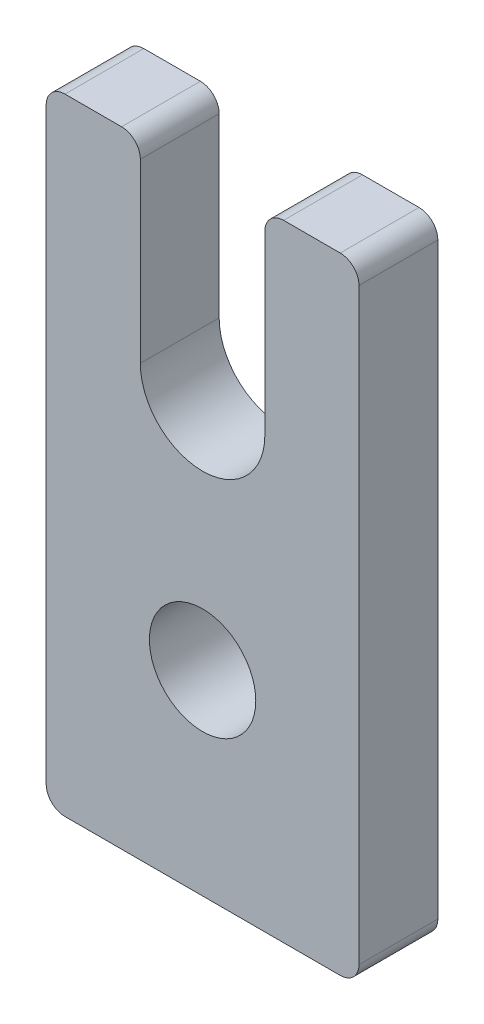
ISO-10303-21;
HEADER;
FILE_DESCRIPTION(('STEP AP214'),'2;1');
FILE_NAME('part.step','',(''),(''),'','','');
FILE_SCHEMA(('AUTOMOTIVE_DESIGN { 1 0 10303 214 1 1 1 1 }'));
ENDSEC;
DATA;
#1=APPLICATION_CONTEXT('core data for automotive mechanical design processes');
#2=APPLICATION_PROTOCOL_DEFINITION('international standard','automotive_design',2000,#1);
#3=PRODUCT_CONTEXT('',#1,'mechanical');
#4=PRODUCT('Part','Part','',(#3));
#5=PRODUCT_RELATED_PRODUCT_CATEGORY('part','',(#4));
#6=PRODUCT_DEFINITION_FORMATION('','',#4);
#7=PRODUCT_DEFINITION_CONTEXT('part definition',#1,'design');
#8=PRODUCT_DEFINITION('design','',#6,#7);
#9=PRODUCT_DEFINITION_SHAPE('','',#8);
#10=(LENGTH_UNIT() NAMED_UNIT(*) SI_UNIT(.MILLI.,.METRE.));
#11=(NAMED_UNIT(*) PLANE_ANGLE_UNIT() SI_UNIT($,.RADIAN.));
#12=(NAMED_UNIT(*) SI_UNIT($,.STERADIAN.) SOLID_ANGLE_UNIT());
#13=UNCERTAINTY_MEASURE_WITH_UNIT(LENGTH_MEASURE(1.E-05),#10,'distance_accuracy_value','');
#14=(GEOMETRIC_REPRESENTATION_CONTEXT(3) GLOBAL_UNCERTAINTY_ASSIGNED_CONTEXT((#13)) GLOBAL_UNIT_ASSIGNED_CONTEXT((#10,
#11,#12)) REPRESENTATION_CONTEXT('',''));
#15=CARTESIAN_POINT('',(0.,0.,0.));
#16=DIRECTION('',(0.,0.,1.));
#17=DIRECTION('',(1.,0.,0.));
#18=AXIS2_PLACEMENT_3D('',#15,#16,#17);
#19=CARTESIAN_POINT('',(6.35,17.4625,3.2004));
#20=DIRECTION('',(0.,0.,1.));
#21=DIRECTION('',(1.,0.,0.));
#22=AXIS2_PLACEMENT_3D('',#19,#20,#21);
#23=PLANE('',#22);
#24=DIRECTION('',(1.,0.,0.));
#25=VECTOR('',#24,1.);
#26=CARTESIAN_POINT('',(0.,0.,3.2004));
#27=LINE('',#26,#25);
#28=CARTESIAN_POINT('',(0.762,0.,3.2004));
#29=VERTEX_POINT('',#28);
#30=CARTESIAN_POINT('',(11.938,0.,3.2004));
#31=VERTEX_POINT('',#30);
#32=EDGE_CURVE('E255',#29,#31,#27,.T.);
#33=ORIENTED_EDGE('',*,*,#32,.T.);
#34=CARTESIAN_POINT('',(11.938,0.762000000000002,3.2004));
#35=DIRECTION('',(0.,0.,1.));
#36=DIRECTION('',(1.,0.,0.));
#37=AXIS2_PLACEMENT_3D('',#34,#35,#36);
#38=CIRCLE('',#37,0.762);
#39=CARTESIAN_POINT('',(12.7,0.762000000000002,3.2004));
#40=VERTEX_POINT('',#39);
#41=EDGE_CURVE('E214',#31,#40,#38,.T.);
#42=ORIENTED_EDGE('',*,*,#41,.T.);
#43=DIRECTION('',(0.,1.,0.));
#44=VECTOR('',#43,1.);
#45=CARTESIAN_POINT('',(12.7,25.4,3.2004));
#46=LINE('',#45,#44);
#47=CARTESIAN_POINT('',(12.7,24.638,3.2004));
#48=VERTEX_POINT('',#47);
#49=EDGE_CURVE('E257',#40,#48,#46,.T.);
#50=ORIENTED_EDGE('',*,*,#49,.T.);
#51=CARTESIAN_POINT('',(11.938,24.638,3.2004));
#52=DIRECTION('',(0.,0.,1.));
#53=DIRECTION('',(1.,0.,0.));
#54=AXIS2_PLACEMENT_3D('',#51,#52,#53);
#55=CIRCLE('',#54,0.762);
#56=CARTESIAN_POINT('',(11.938,25.4,3.2004));
#57=VERTEX_POINT('',#56);
#58=EDGE_CURVE('E207',#48,#57,#55,.T.);
#59=ORIENTED_EDGE('',*,*,#58,.T.);
#60=DIRECTION('',(-1.,0.,0.));
#61=VECTOR('',#60,1.);
#62=CARTESIAN_POINT('',(8.8773,25.4,3.2004));
#63=LINE('',#62,#61);
#64=CARTESIAN_POINT('',(9.6393,25.4,3.2004));
#65=VERTEX_POINT('',#64);
#66=EDGE_CURVE('E142',#57,#65,#63,.T.);
#67=ORIENTED_EDGE('',*,*,#66,.T.);
#68=CARTESIAN_POINT('',(9.6393,24.638,3.2004));
#69=DIRECTION('',(0.,0.,1.));
#70=DIRECTION('',(1.,0.,0.));
#71=AXIS2_PLACEMENT_3D('',#68,#69,#70);
#72=CIRCLE('',#71,0.762);
#73=CARTESIAN_POINT('',(8.8773,24.638,3.2004));
#74=VERTEX_POINT('',#73);
#75=EDGE_CURVE('E54',#65,#74,#72,.T.);
#76=ORIENTED_EDGE('',*,*,#75,.T.);
#77=DIRECTION('',(0.,-1.,0.));
#78=VECTOR('',#77,1.);
#79=CARTESIAN_POINT('',(8.8773,25.4,3.2004));
#80=LINE('',#79,#78);
#81=CARTESIAN_POINT('',(8.8773,17.4625,3.2004));
#82=VERTEX_POINT('',#81);
#83=EDGE_CURVE('E132',#74,#82,#80,.T.);
#84=ORIENTED_EDGE('',*,*,#83,.T.);
#85=CARTESIAN_POINT('',(6.35,17.4625,3.2004));
#86=DIRECTION('',(0.,0.,-1.));
#87=DIRECTION('',(1.,0.,0.));
#88=AXIS2_PLACEMENT_3D('',#85,#86,#87);
#89=CIRCLE('',#88,2.5273);
#90=CARTESIAN_POINT('',(3.8227,17.4625,3.2004));
#91=VERTEX_POINT('',#90);
#92=EDGE_CURVE('E137',#82,#91,#89,.T.);
#93=ORIENTED_EDGE('',*,*,#92,.T.);
#94=DIRECTION('',(0.,1.,0.));
#95=VECTOR('',#94,1.);
#96=CARTESIAN_POINT('',(3.8227,25.4,3.2004));
#97=LINE('',#96,#95);
#98=CARTESIAN_POINT('',(3.8227,24.638,3.2004));
#99=VERTEX_POINT('',#98);
#100=EDGE_CURVE('E156',#91,#99,#97,.T.);
#101=ORIENTED_EDGE('',*,*,#100,.T.);
#102=CARTESIAN_POINT('',(3.0607,24.638,3.2004));
#103=DIRECTION('',(0.,0.,1.));
#104=DIRECTION('',(1.,0.,0.));
#105=AXIS2_PLACEMENT_3D('',#102,#103,#104);
#106=CIRCLE('',#105,0.762);
#107=CARTESIAN_POINT('',(3.0607,25.4,3.2004));
#108=VERTEX_POINT('',#107);
#109=EDGE_CURVE('E209',#99,#108,#106,.T.);
#110=ORIENTED_EDGE('',*,*,#109,.T.);
#111=DIRECTION('',(-1.,0.,0.));
#112=VECTOR('',#111,1.);
#113=CARTESIAN_POINT('',(0.,25.4,3.2004));
#114=LINE('',#113,#112);
#115=CARTESIAN_POINT('',(0.762,25.4,3.2004));
#116=VERTEX_POINT('',#115);
#117=EDGE_CURVE('E182',#108,#116,#114,.T.);
#118=ORIENTED_EDGE('',*,*,#117,.T.);
#119=CARTESIAN_POINT('',(0.762,24.638,3.2004));
#120=DIRECTION('',(0.,0.,1.));
#121=DIRECTION('',(1.,0.,0.));
#122=AXIS2_PLACEMENT_3D('',#119,#120,#121);
#123=CIRCLE('',#122,0.762);
#124=CARTESIAN_POINT('',(0.,24.638,3.2004));
#125=VERTEX_POINT('',#124);
#126=EDGE_CURVE('E205',#116,#125,#123,.T.);
#127=ORIENTED_EDGE('',*,*,#126,.T.);
#128=DIRECTION('',(0.,-1.,0.));
#129=VECTOR('',#128,1.);
#130=CARTESIAN_POINT('',(0.,25.4,3.2004));
#131=LINE('',#130,#129);
#132=CARTESIAN_POINT('',(0.,0.761999999999999,3.2004));
#133=VERTEX_POINT('',#132);
#134=EDGE_CURVE('E253',#125,#133,#131,.T.);
#135=ORIENTED_EDGE('',*,*,#134,.T.);
#136=CARTESIAN_POINT('',(0.762,0.762,3.2004));
#137=DIRECTION('',(0.,0.,1.));
#138=DIRECTION('',(1.,0.,0.));
#139=AXIS2_PLACEMENT_3D('',#136,#137,#138);
#140=CIRCLE('',#139,0.762);
#141=EDGE_CURVE('E212',#133,#29,#140,.T.);
#142=ORIENTED_EDGE('',*,*,#141,.T.);
#143=EDGE_LOOP('',(#33,#42,#50,#59,#67,#76,#84,#93,#101,#110,#118,#127,#135,#142));
#144=FACE_BOUND('',#143,.T.);
#145=CARTESIAN_POINT('',(6.35,7.9375,3.2004));
#146=DIRECTION('',(0.,0.,1.));
#147=DIRECTION('',(1.,0.,0.));
#148=AXIS2_PLACEMENT_3D('',#145,#146,#147);
#149=CIRCLE('',#148,2.159);
#150=CARTESIAN_POINT('',(8.509,7.9375,3.2004));
#151=VERTEX_POINT('',#150);
#152=EDGE_CURVE('E165',#151,#151,#149,.T.);
#153=ORIENTED_EDGE('',*,*,#152,.F.);
#154=EDGE_LOOP('',(#153));
#155=FACE_BOUND('',#154,.T.);
#156=ADVANCED_FACE('F33',(#144,#155),#23,.T.);
#157=CARTESIAN_POINT('',(6.35,17.4625,0.));
#158=DIRECTION('',(0.,0.,1.));
#159=DIRECTION('',(1.,0.,0.));
#160=AXIS2_PLACEMENT_3D('',#157,#158,#159);
#161=PLANE('',#160);
#162=DIRECTION('',(0.,1.,0.));
#163=VECTOR('',#162,1.);
#164=CARTESIAN_POINT('',(12.7,25.4,0.));
#165=LINE('',#164,#163);
#166=CARTESIAN_POINT('',(12.7,0.762000000000002,0.));
#167=VERTEX_POINT('',#166);
#168=CARTESIAN_POINT('',(12.7,24.638,0.));
#169=VERTEX_POINT('',#168);
#170=EDGE_CURVE('E171',#167,#169,#165,.T.);
#171=ORIENTED_EDGE('',*,*,#170,.F.);
#172=CARTESIAN_POINT('',(11.938,0.762000000000002,0.));
#173=DIRECTION('',(0.,0.,1.));
#174=DIRECTION('',(1.,0.,0.));
#175=AXIS2_PLACEMENT_3D('',#172,#173,#174);
#176=CIRCLE('',#175,0.762);
#177=CARTESIAN_POINT('',(11.938,0.,0.));
#178=VERTEX_POINT('',#177);
#179=EDGE_CURVE('E198',#167,#178,#176,.F.);
#180=ORIENTED_EDGE('',*,*,#179,.T.);
#181=DIRECTION('',(1.,0.,0.));
#182=VECTOR('',#181,1.);
#183=CARTESIAN_POINT('',(0.,0.,0.));
#184=LINE('',#183,#182);
#185=CARTESIAN_POINT('',(0.762,0.,0.));
#186=VERTEX_POINT('',#185);
#187=EDGE_CURVE('E168',#186,#178,#184,.T.);
#188=ORIENTED_EDGE('',*,*,#187,.F.);
#189=CARTESIAN_POINT('',(0.762,0.762,0.));
#190=DIRECTION('',(0.,0.,1.));
#191=DIRECTION('',(1.,0.,0.));
#192=AXIS2_PLACEMENT_3D('',#189,#190,#191);
#193=CIRCLE('',#192,0.762);
#194=CARTESIAN_POINT('',(0.,0.761999999999999,0.));
#195=VERTEX_POINT('',#194);
#196=EDGE_CURVE('E196',#186,#195,#193,.F.);
#197=ORIENTED_EDGE('',*,*,#196,.T.);
#198=DIRECTION('',(0.,-1.,0.));
#199=VECTOR('',#198,1.);
#200=CARTESIAN_POINT('',(0.,25.4,0.));
#201=LINE('',#200,#199);
#202=CARTESIAN_POINT('',(0.,24.638,0.));
#203=VERTEX_POINT('',#202);
#204=EDGE_CURVE('E164',#203,#195,#201,.T.);
#205=ORIENTED_EDGE('',*,*,#204,.F.);
#206=CARTESIAN_POINT('',(0.762,24.638,0.));
#207=DIRECTION('',(0.,0.,1.));
#208=DIRECTION('',(1.,0.,0.));
#209=AXIS2_PLACEMENT_3D('',#206,#207,#208);
#210=CIRCLE('',#209,0.762);
#211=CARTESIAN_POINT('',(0.762,25.4,0.));
#212=VERTEX_POINT('',#211);
#213=EDGE_CURVE('E188',#203,#212,#210,.F.);
#214=ORIENTED_EDGE('',*,*,#213,.T.);
#215=DIRECTION('',(-1.,0.,0.));
#216=VECTOR('',#215,1.);
#217=CARTESIAN_POINT('',(0.,25.4,0.));
#218=LINE('',#217,#216);
#219=CARTESIAN_POINT('',(3.0607,25.4,0.));
#220=VERTEX_POINT('',#219);
#221=EDGE_CURVE('E161',#220,#212,#218,.T.);
#222=ORIENTED_EDGE('',*,*,#221,.F.);
#223=CARTESIAN_POINT('',(3.0607,24.638,0.));
#224=DIRECTION('',(0.,0.,1.));
#225=DIRECTION('',(1.,0.,0.));
#226=AXIS2_PLACEMENT_3D('',#223,#224,#225);
#227=CIRCLE('',#226,0.762);
#228=CARTESIAN_POINT('',(3.8227,24.638,0.));
#229=VERTEX_POINT('',#228);
#230=EDGE_CURVE('E192',#220,#229,#227,.F.);
#231=ORIENTED_EDGE('',*,*,#230,.T.);
#232=DIRECTION('',(0.,1.,0.));
#233=VECTOR('',#232,1.);
#234=CARTESIAN_POINT('',(3.8227,25.4,0.));
#235=LINE('',#234,#233);
#236=CARTESIAN_POINT('',(3.8227,17.4625,0.));
#237=VERTEX_POINT('',#236);
#238=EDGE_CURVE('E180',#237,#229,#235,.T.);
#239=ORIENTED_EDGE('',*,*,#238,.F.);
#240=CARTESIAN_POINT('',(6.35,17.4625,0.));
#241=DIRECTION('',(0.,0.,-1.));
#242=DIRECTION('',(1.,0.,0.));
#243=AXIS2_PLACEMENT_3D('',#240,#241,#242);
#244=CIRCLE('',#243,2.5273);
#245=CARTESIAN_POINT('',(8.8773,17.4625,0.));
#246=VERTEX_POINT('',#245);
#247=EDGE_CURVE('E178',#246,#237,#244,.T.);
#248=ORIENTED_EDGE('',*,*,#247,.F.);
#249=DIRECTION('',(0.,-1.,0.));
#250=VECTOR('',#249,1.);
#251=CARTESIAN_POINT('',(8.8773,25.4,0.));
#252=LINE('',#251,#250);
#253=CARTESIAN_POINT('',(8.8773,24.638,0.));
#254=VERTEX_POINT('',#253);
#255=EDGE_CURVE('E148',#254,#246,#252,.T.);
#256=ORIENTED_EDGE('',*,*,#255,.F.);
#257=CARTESIAN_POINT('',(9.6393,24.638,0.));
#258=DIRECTION('',(0.,0.,1.));
#259=DIRECTION('',(1.,0.,0.));
#260=AXIS2_PLACEMENT_3D('',#257,#258,#259);
#261=CIRCLE('',#260,0.762);
#262=CARTESIAN_POINT('',(9.6393,25.4,0.));
#263=VERTEX_POINT('',#262);
#264=EDGE_CURVE('E194',#254,#263,#261,.F.);
#265=ORIENTED_EDGE('',*,*,#264,.T.);
#266=DIRECTION('',(-1.,0.,0.));
#267=VECTOR('',#266,1.);
#268=CARTESIAN_POINT('',(8.8773,25.4,0.));
#269=LINE('',#268,#267);
#270=CARTESIAN_POINT('',(11.938,25.4,0.));
#271=VERTEX_POINT('',#270);
#272=EDGE_CURVE('E174',#271,#263,#269,.T.);
#273=ORIENTED_EDGE('',*,*,#272,.F.);
#274=CARTESIAN_POINT('',(11.938,24.638,0.));
#275=DIRECTION('',(0.,0.,1.));
#276=DIRECTION('',(1.,0.,0.));
#277=AXIS2_PLACEMENT_3D('',#274,#275,#276);
#278=CIRCLE('',#277,0.762);
#279=EDGE_CURVE('E190',#271,#169,#278,.F.);
#280=ORIENTED_EDGE('',*,*,#279,.T.);
#281=EDGE_LOOP('',(#171,#180,#188,#197,#205,#214,#222,#231,#239,#248,#256,#265,#273,#280));
#282=FACE_BOUND('',#281,.T.);
#283=CARTESIAN_POINT('',(6.35,7.9375,0.));
#284=DIRECTION('',(0.,0.,1.));
#285=DIRECTION('',(1.,0.,0.));
#286=AXIS2_PLACEMENT_3D('',#283,#284,#285);
#287=CIRCLE('',#286,2.159);
#288=CARTESIAN_POINT('',(8.509,7.9375,0.));
#289=VERTEX_POINT('',#288);
#290=EDGE_CURVE('E433',#289,#289,#287,.T.);
#291=ORIENTED_EDGE('',*,*,#290,.T.);
#292=EDGE_LOOP('',(#291));
#293=FACE_BOUND('',#292,.T.);
#294=ADVANCED_FACE('F241',(#282,#293),#161,.F.);
#295=CARTESIAN_POINT('',(0.,25.4,3.2004));
#296=DIRECTION('',(0.,-1.,0.));
#297=DIRECTION('',(0.,0.,-1.));
#298=AXIS2_PLACEMENT_3D('',#295,#296,#297);
#299=PLANE('',#298);
#300=ORIENTED_EDGE('',*,*,#117,.F.);
#301=DIRECTION('',(0.,0.,-1.));
#302=VECTOR('',#301,1.);
#303=CARTESIAN_POINT('',(3.0607,25.4,3.2004));
#304=LINE('',#303,#302);
#305=EDGE_CURVE('E41',#108,#220,#304,.T.);
#306=ORIENTED_EDGE('',*,*,#305,.T.);
#307=ORIENTED_EDGE('',*,*,#221,.T.);
#308=DIRECTION('',(0.,0.,-1.));
#309=VECTOR('',#308,1.);
#310=CARTESIAN_POINT('',(0.762,25.4,3.2004));
#311=LINE('',#310,#309);
#312=EDGE_CURVE('E228',#212,#116,#311,.F.);
#313=ORIENTED_EDGE('',*,*,#312,.T.);
#314=EDGE_LOOP('',(#300,#306,#307,#313));
#315=FACE_BOUND('',#314,.T.);
#316=ADVANCED_FACE('F234',(#315),#299,.F.);
#317=CARTESIAN_POINT('',(0.,25.4,3.2004));
#318=DIRECTION('',(1.,0.,0.));
#319=DIRECTION('',(0.,0.,-1.));
#320=AXIS2_PLACEMENT_3D('',#317,#318,#319);
#321=PLANE('',#320);
#322=ORIENTED_EDGE('',*,*,#204,.T.);
#323=DIRECTION('',(0.,0.,-1.));
#324=VECTOR('',#323,1.);
#325=CARTESIAN_POINT('',(0.,0.761999999999999,3.2004));
#326=LINE('',#325,#324);
#327=EDGE_CURVE('E219',#195,#133,#326,.F.);
#328=ORIENTED_EDGE('',*,*,#327,.T.);
#329=ORIENTED_EDGE('',*,*,#134,.F.);
#330=DIRECTION('',(0.,0.,-1.));
#331=VECTOR('',#330,1.);
#332=CARTESIAN_POINT('',(0.,24.638,3.2004));
#333=LINE('',#332,#331);
#334=EDGE_CURVE('E216',#125,#203,#333,.T.);
#335=ORIENTED_EDGE('',*,*,#334,.T.);
#336=EDGE_LOOP('',(#322,#328,#329,#335));
#337=FACE_BOUND('',#336,.T.);
#338=ADVANCED_FACE('F250',(#337),#321,.F.);
#339=CARTESIAN_POINT('',(0.,0.,3.2004));
#340=DIRECTION('',(0.,1.,0.));
#341=DIRECTION('',(-1.,0.,0.));
#342=AXIS2_PLACEMENT_3D('',#339,#340,#341);
#343=PLANE('',#342);
#344=ORIENTED_EDGE('',*,*,#187,.T.);
#345=DIRECTION('',(0.,0.,-1.));
#346=VECTOR('',#345,1.);
#347=CARTESIAN_POINT('',(11.938,0.,3.2004));
#348=LINE('',#347,#346);
#349=EDGE_CURVE('E203',#178,#31,#348,.F.);
#350=ORIENTED_EDGE('',*,*,#349,.T.);
#351=ORIENTED_EDGE('',*,*,#32,.F.);
#352=DIRECTION('',(0.,0.,-1.));
#353=VECTOR('',#352,1.);
#354=CARTESIAN_POINT('',(0.762,0.,3.2004));
#355=LINE('',#354,#353);
#356=EDGE_CURVE('E200',#29,#186,#355,.T.);
#357=ORIENTED_EDGE('',*,*,#356,.T.);
#358=EDGE_LOOP('',(#344,#350,#351,#357));
#359=FACE_BOUND('',#358,.T.);
#360=ADVANCED_FACE('F305',(#359),#343,.F.);
#361=CARTESIAN_POINT('',(12.7,25.4,3.2004));
#362=DIRECTION('',(-1.,0.,0.));
#363=DIRECTION('',(0.,-1.,0.));
#364=AXIS2_PLACEMENT_3D('',#361,#362,#363);
#365=PLANE('',#364);
#366=ORIENTED_EDGE('',*,*,#49,.F.);
#367=DIRECTION('',(0.,0.,-1.));
#368=VECTOR('',#367,1.);
#369=CARTESIAN_POINT('',(12.7,0.762000000000002,3.2004));
#370=LINE('',#369,#368);
#371=EDGE_CURVE('E185',#40,#167,#370,.T.);
#372=ORIENTED_EDGE('',*,*,#371,.T.);
#373=ORIENTED_EDGE('',*,*,#170,.T.);
#374=DIRECTION('',(0.,0.,-1.));
#375=VECTOR('',#374,1.);
#376=CARTESIAN_POINT('',(12.7,24.638,3.2004));
#377=LINE('',#376,#375);
#378=EDGE_CURVE('E151',#169,#48,#377,.F.);
#379=ORIENTED_EDGE('',*,*,#378,.T.);
#380=EDGE_LOOP('',(#366,#372,#373,#379));
#381=FACE_BOUND('',#380,.T.);
#382=ADVANCED_FACE('F302',(#381),#365,.F.);
#383=CARTESIAN_POINT('',(8.8773,25.4,3.2004));
#384=DIRECTION('',(0.,-1.,0.));
#385=DIRECTION('',(1.,0.,0.));
#386=AXIS2_PLACEMENT_3D('',#383,#384,#385);
#387=PLANE('',#386);
#388=ORIENTED_EDGE('',*,*,#272,.T.);
#389=DIRECTION('',(0.,0.,-1.));
#390=VECTOR('',#389,1.);
#391=CARTESIAN_POINT('',(9.6393,25.4,3.2004));
#392=LINE('',#391,#390);
#393=EDGE_CURVE('E226',#263,#65,#392,.F.);
#394=ORIENTED_EDGE('',*,*,#393,.T.);
#395=ORIENTED_EDGE('',*,*,#66,.F.);
#396=DIRECTION('',(0.,0.,-1.));
#397=VECTOR('',#396,1.);
#398=CARTESIAN_POINT('',(11.938,25.4,3.2004));
#399=LINE('',#398,#397);
#400=EDGE_CURVE('E223',#57,#271,#399,.T.);
#401=ORIENTED_EDGE('',*,*,#400,.T.);
#402=EDGE_LOOP('',(#388,#394,#395,#401));
#403=FACE_BOUND('',#402,.T.);
#404=ADVANCED_FACE('F299',(#403),#387,.F.);
#405=CARTESIAN_POINT('',(8.8773,25.4,3.2004));
#406=DIRECTION('',(1.,0.,0.));
#407=DIRECTION('',(0.,1.,0.));
#408=AXIS2_PLACEMENT_3D('',#405,#406,#407);
#409=PLANE('',#408);
#410=ORIENTED_EDGE('',*,*,#83,.F.);
#411=DIRECTION('',(0.,0.,-1.));
#412=VECTOR('',#411,1.);
#413=CARTESIAN_POINT('',(8.8773,24.638,3.2004));
#414=LINE('',#413,#412);
#415=EDGE_CURVE('E221',#74,#254,#414,.T.);
#416=ORIENTED_EDGE('',*,*,#415,.T.);
#417=ORIENTED_EDGE('',*,*,#255,.T.);
#418=DIRECTION('',(0.,0.,-1.));
#419=VECTOR('',#418,1.);
#420=CARTESIAN_POINT('',(8.8773,17.4625,3.2004));
#421=LINE('',#420,#419);
#422=EDGE_CURVE('E145',#82,#246,#421,.T.);
#423=ORIENTED_EDGE('',*,*,#422,.F.);
#424=EDGE_LOOP('',(#410,#416,#417,#423));
#425=FACE_BOUND('',#424,.T.);
#426=ADVANCED_FACE('F146',(#425),#409,.F.);
#427=CARTESIAN_POINT('',(6.35,17.4625,3.2004));
#428=DIRECTION('',(0.,0.,-1.));
#429=DIRECTION('',(-1.,0.,0.));
#430=AXIS2_PLACEMENT_3D('',#427,#428,#429);
#431=CYLINDRICAL_SURFACE('',#430,2.5273);
#432=ORIENTED_EDGE('',*,*,#247,.T.);
#433=DIRECTION('',(0.,0.,-1.));
#434=VECTOR('',#433,1.);
#435=CARTESIAN_POINT('',(3.8227,17.4625,3.2004));
#436=LINE('',#435,#434);
#437=EDGE_CURVE('E152',#91,#237,#436,.T.);
#438=ORIENTED_EDGE('',*,*,#437,.F.);
#439=ORIENTED_EDGE('',*,*,#92,.F.);
#440=ORIENTED_EDGE('',*,*,#422,.T.);
#441=EDGE_LOOP('',(#432,#438,#439,#440));
#442=FACE_BOUND('',#441,.T.);
#443=ADVANCED_FACE('F154',(#442),#431,.F.);
#444=CARTESIAN_POINT('',(3.8227,25.4,3.2004));
#445=DIRECTION('',(-1.,0.,0.));
#446=DIRECTION('',(0.,-1.,0.));
#447=AXIS2_PLACEMENT_3D('',#444,#445,#446);
#448=PLANE('',#447);
#449=ORIENTED_EDGE('',*,*,#238,.T.);
#450=DIRECTION('',(0.,0.,-1.));
#451=VECTOR('',#450,1.);
#452=CARTESIAN_POINT('',(3.8227,24.638,3.2004));
#453=LINE('',#452,#451);
#454=EDGE_CURVE('E11',#229,#99,#453,.F.);
#455=ORIENTED_EDGE('',*,*,#454,.T.);
#456=ORIENTED_EDGE('',*,*,#100,.F.);
#457=ORIENTED_EDGE('',*,*,#437,.T.);
#458=EDGE_LOOP('',(#449,#455,#456,#457));
#459=FACE_BOUND('',#458,.T.);
#460=ADVANCED_FACE('F271',(#459),#448,.F.);
#461=CARTESIAN_POINT('',(6.35,7.9375,3.2004));
#462=DIRECTION('',(0.,0.,-1.));
#463=DIRECTION('',(-1.,0.,0.));
#464=AXIS2_PLACEMENT_3D('',#461,#462,#463);
#465=CYLINDRICAL_SURFACE('',#464,2.159);
#466=ORIENTED_EDGE('',*,*,#152,.T.);
#467=EDGE_LOOP('',(#466));
#468=FACE_BOUND('',#467,.T.);
#469=ORIENTED_EDGE('',*,*,#290,.F.);
#470=EDGE_LOOP('',(#469));
#471=FACE_BOUND('',#470,.T.);
#472=ADVANCED_FACE('F291',(#468,#471),#465,.F.);
#473=CARTESIAN_POINT('',(11.938,0.762000000000002,3.2004));
#474=DIRECTION('',(0.,0.,-1.));
#475=DIRECTION('',(-1.,0.,0.));
#476=AXIS2_PLACEMENT_3D('',#473,#474,#475);
#477=CYLINDRICAL_SURFACE('',#476,0.762);
#478=ORIENTED_EDGE('',*,*,#41,.F.);
#479=ORIENTED_EDGE('',*,*,#349,.F.);
#480=ORIENTED_EDGE('',*,*,#179,.F.);
#481=ORIENTED_EDGE('',*,*,#371,.F.);
#482=EDGE_LOOP('',(#478,#479,#480,#481));
#483=FACE_BOUND('',#482,.T.);
#484=ADVANCED_FACE('F314',(#483),#477,.T.);
#485=CARTESIAN_POINT('',(0.762,0.762,3.2004));
#486=DIRECTION('',(0.,0.,-1.));
#487=DIRECTION('',(-1.,0.,0.));
#488=AXIS2_PLACEMENT_3D('',#485,#486,#487);
#489=CYLINDRICAL_SURFACE('',#488,0.762);
#490=ORIENTED_EDGE('',*,*,#141,.F.);
#491=ORIENTED_EDGE('',*,*,#327,.F.);
#492=ORIENTED_EDGE('',*,*,#196,.F.);
#493=ORIENTED_EDGE('',*,*,#356,.F.);
#494=EDGE_LOOP('',(#490,#491,#492,#493));
#495=FACE_BOUND('',#494,.T.);
#496=ADVANCED_FACE('F281',(#495),#489,.T.);
#497=CARTESIAN_POINT('',(9.6393,24.638,3.2004));
#498=DIRECTION('',(0.,0.,-1.));
#499=DIRECTION('',(-1.,0.,0.));
#500=AXIS2_PLACEMENT_3D('',#497,#498,#499);
#501=CYLINDRICAL_SURFACE('',#500,0.762);
#502=ORIENTED_EDGE('',*,*,#75,.F.);
#503=ORIENTED_EDGE('',*,*,#393,.F.);
#504=ORIENTED_EDGE('',*,*,#264,.F.);
#505=ORIENTED_EDGE('',*,*,#415,.F.);
#506=EDGE_LOOP('',(#502,#503,#504,#505));
#507=FACE_BOUND('',#506,.T.);
#508=ADVANCED_FACE('F269',(#507),#501,.T.);
#509=CARTESIAN_POINT('',(3.0607,24.638,3.2004));
#510=DIRECTION('',(0.,0.,-1.));
#511=DIRECTION('',(-1.,0.,0.));
#512=AXIS2_PLACEMENT_3D('',#509,#510,#511);
#513=CYLINDRICAL_SURFACE('',#512,0.762);
#514=ORIENTED_EDGE('',*,*,#109,.F.);
#515=ORIENTED_EDGE('',*,*,#454,.F.);
#516=ORIENTED_EDGE('',*,*,#230,.F.);
#517=ORIENTED_EDGE('',*,*,#305,.F.);
#518=EDGE_LOOP('',(#514,#515,#516,#517));
#519=FACE_BOUND('',#518,.T.);
#520=ADVANCED_FACE('F272',(#519),#513,.T.);
#521=CARTESIAN_POINT('',(11.938,24.638,3.2004));
#522=DIRECTION('',(0.,0.,-1.));
#523=DIRECTION('',(-1.,0.,0.));
#524=AXIS2_PLACEMENT_3D('',#521,#522,#523);
#525=CYLINDRICAL_SURFACE('',#524,0.762);
#526=ORIENTED_EDGE('',*,*,#58,.F.);
#527=ORIENTED_EDGE('',*,*,#378,.F.);
#528=ORIENTED_EDGE('',*,*,#279,.F.);
#529=ORIENTED_EDGE('',*,*,#400,.F.);
#530=EDGE_LOOP('',(#526,#527,#528,#529));
#531=FACE_BOUND('',#530,.T.);
#532=ADVANCED_FACE('F274',(#531),#525,.T.);
#533=CARTESIAN_POINT('',(0.762,24.638,3.2004));
#534=DIRECTION('',(0.,0.,-1.));
#535=DIRECTION('',(-1.,0.,0.));
#536=AXIS2_PLACEMENT_3D('',#533,#534,#535);
#537=CYLINDRICAL_SURFACE('',#536,0.762);
#538=ORIENTED_EDGE('',*,*,#126,.F.);
#539=ORIENTED_EDGE('',*,*,#312,.F.);
#540=ORIENTED_EDGE('',*,*,#213,.F.);
#541=ORIENTED_EDGE('',*,*,#334,.F.);
#542=EDGE_LOOP('',(#538,#539,#540,#541));
#543=FACE_BOUND('',#542,.T.);
#544=ADVANCED_FACE('F35',(#543),#537,.T.);
#545=CLOSED_SHELL('',(#156,#294,#316,#338,#360,#382,#404,#426,#443,#460,#472,#484,#496,#508,
#520,#532,#544));
#546=MANIFOLD_SOLID_BREP('B2',#545);
#547=ADVANCED_BREP_SHAPE_REPRESENTATION('',(#18,#546),#14);
#548=SHAPE_DEFINITION_REPRESENTATION(#9,#547);
ENDSEC;
END-ISO-10303-21;
